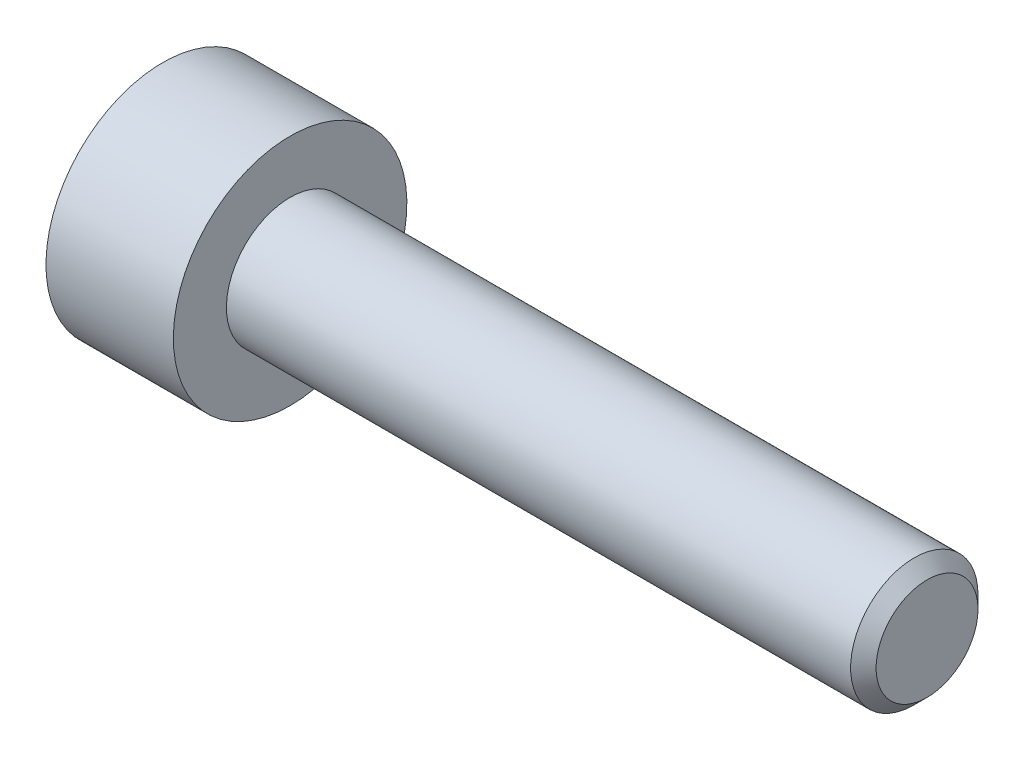
ISO-10303-21;
HEADER;
FILE_DESCRIPTION(('STEP AP214'),'2;1');
FILE_NAME('part.step','',(''),(''),'','','');
FILE_SCHEMA(('AUTOMOTIVE_DESIGN { 1 0 10303 214 1 1 1 1 }'));
ENDSEC;
DATA;
#1=APPLICATION_CONTEXT('core data for automotive mechanical design processes');
#2=APPLICATION_PROTOCOL_DEFINITION('international standard','automotive_design',2000,#1);
#3=PRODUCT_CONTEXT('',#1,'mechanical');
#4=PRODUCT('Part','Part','',(#3));
#5=PRODUCT_RELATED_PRODUCT_CATEGORY('part','',(#4));
#6=PRODUCT_DEFINITION_FORMATION('','',#4);
#7=PRODUCT_DEFINITION_CONTEXT('part definition',#1,'design');
#8=PRODUCT_DEFINITION('design','',#6,#7);
#9=PRODUCT_DEFINITION_SHAPE('','',#8);
#10=(LENGTH_UNIT() NAMED_UNIT(*) SI_UNIT(.MILLI.,.METRE.));
#11=(NAMED_UNIT(*) PLANE_ANGLE_UNIT() SI_UNIT($,.RADIAN.));
#12=(NAMED_UNIT(*) SI_UNIT($,.STERADIAN.) SOLID_ANGLE_UNIT());
#13=UNCERTAINTY_MEASURE_WITH_UNIT(LENGTH_MEASURE(1.E-05),#10,'distance_accuracy_value','');
#14=(GEOMETRIC_REPRESENTATION_CONTEXT(3) GLOBAL_UNCERTAINTY_ASSIGNED_CONTEXT((#13)) GLOBAL_UNIT_ASSIGNED_CONTEXT((#10,
#11,#12)) REPRESENTATION_CONTEXT('',''));
#15=CARTESIAN_POINT('',(0.,0.,0.));
#16=DIRECTION('',(0.,0.,1.));
#17=DIRECTION('',(1.,0.,0.));
#18=AXIS2_PLACEMENT_3D('',#15,#16,#17);
#19=CARTESIAN_POINT('',(-15.,0.,0.));
#20=DIRECTION('',(1.,0.,0.));
#21=DIRECTION('',(0.,0.,-1.));
#22=AXIS2_PLACEMENT_3D('',#19,#20,#21);
#23=CYLINDRICAL_SURFACE('',#22,1.5);
#24=CARTESIAN_POINT('',(-0.300000000000002,0.,0.));
#25=DIRECTION('',(1.,0.,0.));
#26=DIRECTION('',(0.,0.,-1.));
#27=AXIS2_PLACEMENT_3D('',#24,#25,#26);
#28=CIRCLE('',#27,1.5);
#29=CARTESIAN_POINT('',(-0.300000000000002,0.,-1.5));
#30=VERTEX_POINT('',#29);
#31=EDGE_CURVE('E45',#30,#30,#28,.F.);
#32=ORIENTED_EDGE('',*,*,#31,.T.);
#33=EDGE_LOOP('',(#32));
#34=FACE_BOUND('',#33,.T.);
#35=CARTESIAN_POINT('',(-15.,0.,0.));
#36=DIRECTION('',(-1.,0.,0.));
#37=DIRECTION('',(0.,-1.,0.));
#38=AXIS2_PLACEMENT_3D('',#35,#36,#37);
#39=CIRCLE('',#38,1.5);
#40=CARTESIAN_POINT('',(-15.,-1.50000000000001,0.));
#41=VERTEX_POINT('',#40);
#42=EDGE_CURVE('E121',#41,#41,#39,.F.);
#43=ORIENTED_EDGE('',*,*,#42,.T.);
#44=EDGE_LOOP('',(#43));
#45=FACE_BOUND('',#44,.T.);
#46=ADVANCED_FACE('F32',(#34,#45),#23,.T.);
#47=CARTESIAN_POINT('',(0.,0.,0.));
#48=DIRECTION('',(1.,0.,0.));
#49=DIRECTION('',(0.,0.,-1.));
#50=AXIS2_PLACEMENT_3D('',#47,#48,#49);
#51=PLANE('',#50);
#52=CARTESIAN_POINT('',(0.,0.,0.));
#53=DIRECTION('',(1.,0.,0.));
#54=DIRECTION('',(0.,0.,-1.));
#55=AXIS2_PLACEMENT_3D('',#52,#53,#54);
#56=CIRCLE('',#55,1.2);
#57=CARTESIAN_POINT('',(0.,0.,-1.2));
#58=VERTEX_POINT('',#57);
#59=EDGE_CURVE('E124',#58,#58,#56,.T.);
#60=ORIENTED_EDGE('',*,*,#59,.T.);
#61=EDGE_LOOP('',(#60));
#62=FACE_BOUND('',#61,.T.);
#63=ADVANCED_FACE('F134',(#62),#51,.T.);
#64=CARTESIAN_POINT('',(0.,0.,0.));
#65=DIRECTION('',(-1.,0.,0.));
#66=DIRECTION('',(0.,0.,1.));
#67=AXIS2_PLACEMENT_3D('',#64,#65,#66);
#68=CONICAL_SURFACE('',#67,1.2,0.785398163397449);
#69=ORIENTED_EDGE('',*,*,#31,.F.);
#70=EDGE_LOOP('',(#69));
#71=FACE_BOUND('',#70,.T.);
#72=ORIENTED_EDGE('',*,*,#59,.F.);
#73=EDGE_LOOP('',(#72));
#74=FACE_BOUND('',#73,.T.);
#75=ADVANCED_FACE('F34',(#71,#74),#68,.T.);
#76=CARTESIAN_POINT('',(-18.,0.,0.));
#77=DIRECTION('',(1.,0.,0.));
#78=DIRECTION('',(0.,1.,0.));
#79=AXIS2_PLACEMENT_3D('',#76,#77,#78);
#80=PLANE('',#79);
#81=CARTESIAN_POINT('',(-18.,0.,0.));
#82=DIRECTION('',(-1.,0.,0.));
#83=DIRECTION('',(0.,-1.,0.));
#84=AXIS2_PLACEMENT_3D('',#81,#82,#83);
#85=CIRCLE('',#84,1.49337567297411);
#86=CARTESIAN_POINT('',(-18.,-1.49337567297404,0.));
#87=VERTEX_POINT('',#86);
#88=EDGE_CURVE('E234',#87,#87,#85,.T.);
#89=ORIENTED_EDGE('',*,*,#88,.F.);
#90=EDGE_LOOP('',(#89));
#91=FACE_BOUND('',#90,.T.);
#92=CARTESIAN_POINT('',(-18.,0.,0.));
#93=DIRECTION('',(-1.,0.,0.));
#94=DIRECTION('',(0.,-1.,0.));
#95=AXIS2_PLACEMENT_3D('',#92,#93,#94);
#96=CIRCLE('',#95,2.74999999999998);
#97=CARTESIAN_POINT('',(-18.,-2.74999999999996,0.));
#98=VERTEX_POINT('',#97);
#99=EDGE_CURVE('E118',#98,#98,#96,.T.);
#100=ORIENTED_EDGE('',*,*,#99,.T.);
#101=EDGE_LOOP('',(#100));
#102=FACE_BOUND('',#101,.T.);
#103=ADVANCED_FACE('F133',(#91,#102),#80,.F.);
#104=CARTESIAN_POINT('',(-15.,0.,0.));
#105=DIRECTION('',(-1.,0.,0.));
#106=DIRECTION('',(0.,-1.,0.));
#107=AXIS2_PLACEMENT_3D('',#104,#105,#106);
#108=CYLINDRICAL_SURFACE('',#107,2.74999999999999);
#109=ORIENTED_EDGE('',*,*,#99,.F.);
#110=EDGE_LOOP('',(#109));
#111=FACE_BOUND('',#110,.T.);
#112=CARTESIAN_POINT('',(-15.,0.,0.));
#113=DIRECTION('',(-1.,0.,0.));
#114=DIRECTION('',(0.,-1.,0.));
#115=AXIS2_PLACEMENT_3D('',#112,#113,#114);
#116=CIRCLE('',#115,2.75);
#117=CARTESIAN_POINT('',(-15.,-2.75,0.));
#118=VERTEX_POINT('',#117);
#119=EDGE_CURVE('E115',#118,#118,#116,.T.);
#120=ORIENTED_EDGE('',*,*,#119,.T.);
#121=EDGE_LOOP('',(#120));
#122=FACE_BOUND('',#121,.T.);
#123=ADVANCED_FACE('F145',(#111,#122),#108,.T.);
#124=CARTESIAN_POINT('',(-15.,2.75,0.));
#125=DIRECTION('',(-1.,0.,0.));
#126=DIRECTION('',(0.,-1.,0.));
#127=AXIS2_PLACEMENT_3D('',#124,#125,#126);
#128=PLANE('',#127);
#129=ORIENTED_EDGE('',*,*,#42,.F.);
#130=EDGE_LOOP('',(#129));
#131=FACE_BOUND('',#130,.T.);
#132=ORIENTED_EDGE('',*,*,#119,.F.);
#133=EDGE_LOOP('',(#132));
#134=FACE_BOUND('',#133,.T.);
#135=ADVANCED_FACE('F149',(#131,#134),#128,.F.);
#136=CARTESIAN_POINT('',(-18.,0.,0.));
#137=DIRECTION('',(-1.,0.,0.));
#138=DIRECTION('',(0.,-1.,0.));
#139=AXIS2_PLACEMENT_3D('',#136,#137,#138);
#140=CONICAL_SURFACE('',#139,1.49337567297411,0.78539816339745);
#141=ORIENTED_EDGE('',*,*,#88,.T.);
#142=EDGE_LOOP('',(#141));
#143=FACE_BOUND('',#142,.T.);
#144=CARTESIAN_POINT('',(-18.4014021689884,-1.42396736984797,1.25));
#145=CARTESIAN_POINT('',(-18.375296136448,-1.38922450814774,1.25));
#146=CARTESIAN_POINT('',(-18.3494506563431,-1.35428640192995,1.25));
#147=CARTESIAN_POINT('',(-18.2983879120234,-1.28394100441962,1.25));
#148=CARTESIAN_POINT('',(-18.2731708093588,-1.24853359598575,1.25));
#149=CARTESIAN_POINT('',(-18.1982633539511,-1.14097140016118,1.25));
#150=CARTESIAN_POINT('',(-18.1497190435972,-1.06800495826749,1.25));
#151=CARTESIAN_POINT('',(-18.0545600162985,-0.915095472420334,1.25));
#152=CARTESIAN_POINT('',(-18.0082030382604,-0.834990154954476,1.25));
#153=CARTESIAN_POINT('',(-17.9235039270025,-0.670798348959389,1.25));
#154=CARTESIAN_POINT('',(-17.8851347978723,-0.586726487937136,1.25));
#155=CARTESIAN_POINT('',(-17.8381985020476,-0.460385334768672,1.25));
#156=CARTESIAN_POINT('',(-17.8247021207698,-0.419954113336578,1.25));
#157=CARTESIAN_POINT('',(-17.8009573074475,-0.338129031291256,1.25));
#158=CARTESIAN_POINT('',(-17.7907091035293,-0.296735103284148,1.25));
#159=CARTESIAN_POINT('',(-17.7741594663552,-0.213916243687761,1.25));
#160=CARTESIAN_POINT('',(-17.7677913385525,-0.172504848949309,1.25));
#161=CARTESIAN_POINT('',(-17.7591237196608,-0.0892560954741661,1.25));
#162=CARTESIAN_POINT('',(-17.7568235599981,-0.047418807870274,1.25));
#163=CARTESIAN_POINT('',(-17.7564564105193,0.0348235296905333,1.25));
#164=CARTESIAN_POINT('',(-17.7582455485415,0.0752279922917106,1.25));
#165=CARTESIAN_POINT('',(-17.7656448035135,0.15568700557964,1.25));
#166=CARTESIAN_POINT('',(-17.77125566297,0.195741486737995,1.25));
#167=CARTESIAN_POINT('',(-17.7860898151071,0.275882483894703,1.25));
#168=CARTESIAN_POINT('',(-17.7953738895404,0.315957579678807,1.25));
#169=CARTESIAN_POINT('',(-17.8170656964992,0.395234027395317,1.25));
#170=CARTESIAN_POINT('',(-17.8294731489784,0.434435457318958,1.25));
#171=CARTESIAN_POINT('',(-17.8734108304631,0.558570325397157,1.25));
#172=CARTESIAN_POINT('',(-17.9099744143289,0.641718054005976,1.25));
#173=CARTESIAN_POINT('',(-17.9912478873066,0.804100725662117,1.25));
#174=CARTESIAN_POINT('',(-18.0359871895297,0.883320183915907,1.25));
#175=CARTESIAN_POINT('',(-18.128265228646,1.03470895505826,1.25));
#176=CARTESIAN_POINT('',(-18.1755534388818,1.10703287925041,1.25));
#177=CARTESIAN_POINT('',(-18.2486463209252,1.21358798649194,1.25));
#178=CARTESIAN_POINT('',(-18.2732664432996,1.24864609054885,1.25));
#179=CARTESIAN_POINT('',(-18.323155260131,1.31828380805652,1.25));
#180=CARTESIAN_POINT('',(-18.3484237758017,1.35286354944697,1.25));
#181=CARTESIAN_POINT('',(-18.3739610581168,1.38724419886391,1.25));
#182=B_SPLINE_CURVE_WITH_KNOTS('',3,(#144,#145,#146,#147,#148,#149,#150,#151,#152,#153,#154,
#155,#156,#157,#158,#159,#160,#161,#162,#163,#164,#165,#166,#167,#168,#169,#170,#171,#172,#173,
#174,#175,#176,#177,#178,#179,#180,#181),.UNSPECIFIED.,.F.,.F.,(4,2,2,2,2,2,2,2,2,2,2,2,2,2,2,2,
2,2,4),(0.,0.130370422461752,0.260774023229283,0.523571931962192,0.800995227642812,
1.07746514553945,1.20522972687286,1.33300327939674,1.45851355132218,1.58400319361993,
1.70514602294325,1.826312395336,1.94957373840995,2.0728240336381,2.34451838945525,
2.61721016161588,2.87631588769065,3.00482945023604,3.13330794967365),.UNSPECIFIED.);
#183=CARTESIAN_POINT('',(-17.95,-0.721687836486964,1.25));
#184=VERTEX_POINT('',#183);
#185=CARTESIAN_POINT('',(-17.95,0.7216878364871,1.25));
#186=VERTEX_POINT('',#185);
#187=EDGE_CURVE('E99',#184,#186,#182,.T.);
#188=ORIENTED_EDGE('',*,*,#187,.F.);
#189=CARTESIAN_POINT('',(-17.9501154839091,-1.44349114302783,-0.000200000000000205));
#190=CARTESIAN_POINT('',(-17.9253216680551,-1.41867941875058,0.0427751670715871));
#191=CARTESIAN_POINT('',(-17.9019837344186,-1.39345276980736,0.0864690047459486));
#192=CARTESIAN_POINT('',(-17.8592520040845,-1.34201263554187,0.175565930841943));
#193=CARTESIAN_POINT('',(-17.8398819923604,-1.31579425481269,0.220977498357065));
#194=CARTESIAN_POINT('',(-17.8067004834134,-1.26292610442239,0.312547820935261));
#195=CARTESIAN_POINT('',(-17.7928055590526,-1.23628980770464,0.358683240175887));
#196=CARTESIAN_POINT('',(-17.7713972821606,-1.18243062538502,0.451970080407593));
#197=CARTESIAN_POINT('',(-17.7638679415668,-1.15520938653755,0.49911864913638));
#198=CARTESIAN_POINT('',(-17.7570744980507,-1.1082968436746,0.580373556887252));
#199=CARTESIAN_POINT('',(-17.7560685591043,-1.08866617256951,0.61437487662794));
#200=CARTESIAN_POINT('',(-17.7577614149113,-1.04943932800604,0.682317764432477));
#201=CARTESIAN_POINT('',(-17.7604610272155,-1.02984316311593,0.716259317655657));
#202=CARTESIAN_POINT('',(-17.7694089303163,-0.990839954603431,0.783814856457499));
#203=CARTESIAN_POINT('',(-17.7756605258997,-0.971433104248703,0.817428507286775));
#204=CARTESIAN_POINT('',(-17.7913756814139,-0.932943395609837,0.884094638217813));
#205=CARTESIAN_POINT('',(-17.8008406200874,-0.913860680098233,0.917146871030295));
#206=CARTESIAN_POINT('',(-17.8289313906876,-0.8649863513545,1.00179969160026));
#207=CARTESIAN_POINT('',(-17.8496701574522,-0.835502920149008,1.05286649242964));
#208=CARTESIAN_POINT('',(-17.8963871346714,-0.77769031947584,1.15300085411325));
#209=CARTESIAN_POINT('',(-17.9223482959467,-0.749357745598348,1.20207431157827));
#210=CARTESIAN_POINT('',(-17.9501154839091,-0.721572366433126,1.2502));
#211=B_SPLINE_CURVE_WITH_KNOTS('',3,(#189,#190,#191,#192,#193,#194,#195,#196,#197,#198,#199,
#200,#201,#202,#203,#204,#205,#206,#207,#208,#209,#210),.UNSPECIFIED.,.F.,.F.,(4,2,2,2,2,2,2,2,
2,2,4),(0.,0.166533409618304,0.334037607289763,0.498880396489699,0.663307919240274,
0.780963963458826,0.898645970148452,1.01643764860773,1.13427993171549,1.32148652032141,
1.50809158792574),.UNSPECIFIED.);
#212=CARTESIAN_POINT('',(-17.95,-1.443375672974,0.));
#213=VERTEX_POINT('',#212);
#214=EDGE_CURVE('E191',#213,#184,#211,.T.);
#215=ORIENTED_EDGE('',*,*,#214,.F.);
#216=CARTESIAN_POINT('',(-17.9501154839091,-0.721572366433125,-1.2502));
#217=CARTESIAN_POINT('',(-17.9253216680551,-0.746384090710375,-1.20722483292841));
#218=CARTESIAN_POINT('',(-17.9019837344186,-0.771610739653595,-1.16353099525405));
#219=CARTESIAN_POINT('',(-17.8592520040845,-0.823050873919086,-1.07443406915806));
#220=CARTESIAN_POINT('',(-17.8398819923604,-0.849269254648265,-1.02902250164294));
#221=CARTESIAN_POINT('',(-17.8067004834134,-0.902137405038567,-0.93745217906474));
#222=CARTESIAN_POINT('',(-17.7928055590526,-0.928773701756319,-0.891316759824114));
#223=CARTESIAN_POINT('',(-17.7713972821606,-0.982632884075945,-0.798029919592407));
#224=CARTESIAN_POINT('',(-17.7638679415668,-1.00985412292342,-0.750881350863619));
#225=CARTESIAN_POINT('',(-17.7570744980507,-1.05676666578636,-0.669626443112747));
#226=CARTESIAN_POINT('',(-17.7560685591043,-1.07639733689145,-0.635625123372058));
#227=CARTESIAN_POINT('',(-17.7577614149113,-1.11562418145492,-0.567682235567521));
#228=CARTESIAN_POINT('',(-17.7604610272155,-1.13522034634504,-0.533740682344341));
#229=CARTESIAN_POINT('',(-17.7694089303163,-1.17422355485753,-0.466185143542499));
#230=CARTESIAN_POINT('',(-17.7756605258997,-1.19363040521226,-0.432571492713224));
#231=CARTESIAN_POINT('',(-17.7913756814139,-1.23212011385112,-0.365905361782186));
#232=CARTESIAN_POINT('',(-17.8008406200874,-1.25120282936273,-0.332853128969703));
#233=CARTESIAN_POINT('',(-17.8289313906876,-1.30007715810646,-0.248200308399735));
#234=CARTESIAN_POINT('',(-17.8496701574522,-1.32956058931195,-0.197133507570362));
#235=CARTESIAN_POINT('',(-17.8963871346714,-1.38737318998512,-0.0969991458867468));
#236=CARTESIAN_POINT('',(-17.9223482959467,-1.41570576386261,-0.047925688421732));
#237=CARTESIAN_POINT('',(-17.9501154839091,-1.44349114302783,0.000199999999999059));
#238=B_SPLINE_CURVE_WITH_KNOTS('',3,(#216,#217,#218,#219,#220,#221,#222,#223,#224,#225,#226,
#227,#228,#229,#230,#231,#232,#233,#234,#235,#236,#237),.UNSPECIFIED.,.F.,.F.,(4,2,2,2,2,2,2,2,
2,2,4),(0.,0.166533409618304,0.334037607289764,0.498880396489701,0.663307919240277,
0.78096396345883,0.898645970148456,1.01643764860774,1.1342799317155,1.32148652032141,
1.50809158792574),.UNSPECIFIED.);
#239=CARTESIAN_POINT('',(-17.95,-0.721687836486964,-1.25));
#240=VERTEX_POINT('',#239);
#241=EDGE_CURVE('E186',#240,#213,#238,.T.);
#242=ORIENTED_EDGE('',*,*,#241,.F.);
#243=CARTESIAN_POINT('',(-18.4014021689884,-1.42396736984797,-1.25));
#244=CARTESIAN_POINT('',(-18.375296136448,-1.38922450814774,-1.25));
#245=CARTESIAN_POINT('',(-18.3494506563431,-1.35428640192995,-1.25));
#246=CARTESIAN_POINT('',(-18.2983879120234,-1.28394100441961,-1.25));
#247=CARTESIAN_POINT('',(-18.2731708093588,-1.24853359598575,-1.25));
#248=CARTESIAN_POINT('',(-18.1982633539511,-1.14097140016118,-1.25));
#249=CARTESIAN_POINT('',(-18.1497190435972,-1.06800495826749,-1.25));
#250=CARTESIAN_POINT('',(-18.0545600162985,-0.915095472420334,-1.25));
#251=CARTESIAN_POINT('',(-18.0082030382604,-0.834990154954475,-1.25));
#252=CARTESIAN_POINT('',(-17.9235039270025,-0.670798348959388,-1.25));
#253=CARTESIAN_POINT('',(-17.8851347978723,-0.586726487937136,-1.25));
#254=CARTESIAN_POINT('',(-17.8381985020476,-0.460385334768672,-1.25));
#255=CARTESIAN_POINT('',(-17.8247021207698,-0.419954113336578,-1.25));
#256=CARTESIAN_POINT('',(-17.8009573074475,-0.338129031291256,-1.25));
#257=CARTESIAN_POINT('',(-17.7907091035293,-0.296735103284148,-1.25));
#258=CARTESIAN_POINT('',(-17.7741594663552,-0.213916243687761,-1.25));
#259=CARTESIAN_POINT('',(-17.7677913385525,-0.172504848949309,-1.25));
#260=CARTESIAN_POINT('',(-17.7591237196608,-0.0892560954741656,-1.25));
#261=CARTESIAN_POINT('',(-17.7568235599981,-0.0474188078702733,-1.25));
#262=CARTESIAN_POINT('',(-17.7564564105193,0.0348235296905343,-1.25));
#263=CARTESIAN_POINT('',(-17.7582455485415,0.0752279922917117,-1.25));
#264=CARTESIAN_POINT('',(-17.7656448035135,0.155687005579641,-1.25));
#265=CARTESIAN_POINT('',(-17.77125566297,0.195741486737995,-1.25));
#266=CARTESIAN_POINT('',(-17.7860898151071,0.275882483894704,-1.25));
#267=CARTESIAN_POINT('',(-17.7953738895404,0.315957579678808,-1.25));
#268=CARTESIAN_POINT('',(-17.8170656964992,0.395234027395317,-1.25));
#269=CARTESIAN_POINT('',(-17.8294731489784,0.434435457318958,-1.25));
#270=CARTESIAN_POINT('',(-17.8734108304631,0.558570325397157,-1.25));
#271=CARTESIAN_POINT('',(-17.9099744143289,0.641718054005978,-1.25));
#272=CARTESIAN_POINT('',(-17.9912478873066,0.80410072566212,-1.25));
#273=CARTESIAN_POINT('',(-18.0359871895297,0.883320183915909,-1.25));
#274=CARTESIAN_POINT('',(-18.128265228646,1.03470895505826,-1.25));
#275=CARTESIAN_POINT('',(-18.1755534388818,1.10703287925041,-1.25));
#276=CARTESIAN_POINT('',(-18.2486463209252,1.21358798649194,-1.25));
#277=CARTESIAN_POINT('',(-18.2732664432995,1.24864609054885,-1.25));
#278=CARTESIAN_POINT('',(-18.323155260131,1.31828380805652,-1.25));
#279=CARTESIAN_POINT('',(-18.3484237758017,1.35286354944697,-1.25));
#280=CARTESIAN_POINT('',(-18.3739610581168,1.38724419886391,-1.25));
#281=B_SPLINE_CURVE_WITH_KNOTS('',3,(#243,#244,#245,#246,#247,#248,#249,#250,#251,#252,#253,
#254,#255,#256,#257,#258,#259,#260,#261,#262,#263,#264,#265,#266,#267,#268,#269,#270,#271,#272,
#273,#274,#275,#276,#277,#278,#279,#280),.UNSPECIFIED.,.F.,.F.,(4,2,2,2,2,2,2,2,2,2,2,2,2,2,2,2,
2,2,4),(0.,0.130370422461752,0.260774023229283,0.523571931962191,0.800995227642812,
1.07746514553944,1.20522972687285,1.33300327939674,1.45851355132218,1.58400319361993,
1.70514602294325,1.826312395336,1.94957373840995,2.0728240336381,2.34451838945525,
2.61721016161588,2.87631588769065,3.00482945023603,3.13330794967365),.UNSPECIFIED.);
#282=CARTESIAN_POINT('',(-17.95,0.721687836487101,-1.25));
#283=VERTEX_POINT('',#282);
#284=EDGE_CURVE('E52',#283,#240,#281,.F.);
#285=ORIENTED_EDGE('',*,*,#284,.F.);
#286=CARTESIAN_POINT('',(-17.9501154839091,1.44349114302797,0.000200000000000217));
#287=CARTESIAN_POINT('',(-17.9253216680551,1.41867941875072,-0.0427751670715851));
#288=CARTESIAN_POINT('',(-17.9019837344186,1.3934527698075,-0.0864690047459459));
#289=CARTESIAN_POINT('',(-17.8592520040845,1.34201263554201,-0.175565930841939));
#290=CARTESIAN_POINT('',(-17.8398819923604,1.31579425481283,-0.220977498357062));
#291=CARTESIAN_POINT('',(-17.8067004834134,1.26292610442253,-0.312547820935258));
#292=CARTESIAN_POINT('',(-17.7928055590526,1.23628980770478,-0.358683240175883));
#293=CARTESIAN_POINT('',(-17.7713972821606,1.18243062538515,-0.45197008040759));
#294=CARTESIAN_POINT('',(-17.7638679415667,1.15520938653768,-0.499118649136377));
#295=CARTESIAN_POINT('',(-17.7570744980507,1.10829684367474,-0.58037355688725));
#296=CARTESIAN_POINT('',(-17.7560685591043,1.08866617256965,-0.614374876627938));
#297=CARTESIAN_POINT('',(-17.7577614149113,1.04943932800618,-0.682317764432475));
#298=CARTESIAN_POINT('',(-17.7604610272155,1.02984316311606,-0.716259317655655));
#299=CARTESIAN_POINT('',(-17.7694089303163,0.990839954603569,-0.783814856457496));
#300=CARTESIAN_POINT('',(-17.7756605258997,0.971433104248841,-0.817428507286772));
#301=CARTESIAN_POINT('',(-17.7913756814139,0.932943395609975,-0.88409463821781));
#302=CARTESIAN_POINT('',(-17.8008406200874,0.91386068009837,-0.917146871030292));
#303=CARTESIAN_POINT('',(-17.8289313906875,0.864986351354637,-1.00179969160026));
#304=CARTESIAN_POINT('',(-17.8496701574522,0.835502920149145,-1.05286649242964));
#305=CARTESIAN_POINT('',(-17.8963871346714,0.777690319475978,-1.15300085411325));
#306=CARTESIAN_POINT('',(-17.9223482959467,0.749357745598486,-1.20207431157827));
#307=CARTESIAN_POINT('',(-17.9501154839091,0.721572366433263,-1.2502));
#308=B_SPLINE_CURVE_WITH_KNOTS('',3,(#286,#287,#288,#289,#290,#291,#292,#293,#294,#295,#296,
#297,#298,#299,#300,#301,#302,#303,#304,#305,#306,#307),.UNSPECIFIED.,.F.,.F.,(4,2,2,2,2,2,2,2,
2,2,4),(0.,0.166533409618301,0.334037607289759,0.498880396489695,0.663307919240271,
0.780963963458824,0.898645970148449,1.01643764860773,1.13427993171549,1.3214865203214,
1.50809158792573),.UNSPECIFIED.);
#309=CARTESIAN_POINT('',(-17.95,1.44337567297413,0.));
#310=VERTEX_POINT('',#309);
#311=EDGE_CURVE('E11',#310,#283,#308,.T.);
#312=ORIENTED_EDGE('',*,*,#311,.F.);
#313=CARTESIAN_POINT('',(-17.9501154839091,0.721572366433263,1.2502));
#314=CARTESIAN_POINT('',(-17.9253216680551,0.746384090710512,1.20722483292841));
#315=CARTESIAN_POINT('',(-17.9019837344186,0.771610739653732,1.16353099525405));
#316=CARTESIAN_POINT('',(-17.8592520040845,0.823050873919222,1.07443406915806));
#317=CARTESIAN_POINT('',(-17.8398819923604,0.8492692546484,1.02902250164294));
#318=CARTESIAN_POINT('',(-17.8067004834134,0.902137405038702,0.937452179064742));
#319=CARTESIAN_POINT('',(-17.7928055590526,0.928773701756454,0.891316759824116));
#320=CARTESIAN_POINT('',(-17.7713972821606,0.982632884076079,0.798029919592409));
#321=CARTESIAN_POINT('',(-17.7638679415667,1.00985412292355,0.750881350863622));
#322=CARTESIAN_POINT('',(-17.7570744980507,1.05676666578649,0.669626443112749));
#323=CARTESIAN_POINT('',(-17.7560685591043,1.07639733689158,0.635625123372061));
#324=CARTESIAN_POINT('',(-17.7577614149113,1.11562418145505,0.567682235567525));
#325=CARTESIAN_POINT('',(-17.7604610272155,1.13522034634517,0.533740682344344));
#326=CARTESIAN_POINT('',(-17.7694089303163,1.17422355485766,0.466185143542503));
#327=CARTESIAN_POINT('',(-17.7756605258997,1.19363040521239,0.432571492713228));
#328=CARTESIAN_POINT('',(-17.7913756814139,1.23212011385126,0.36590536178219));
#329=CARTESIAN_POINT('',(-17.8008406200874,1.25120282936286,0.332853128969707));
#330=CARTESIAN_POINT('',(-17.8289313906875,1.3000771581066,0.248200308399738));
#331=CARTESIAN_POINT('',(-17.8496701574522,1.32956058931209,0.197133507570363));
#332=CARTESIAN_POINT('',(-17.8963871346714,1.38737318998526,0.0969991458867462));
#333=CARTESIAN_POINT('',(-17.9223482959467,1.41570576386275,0.0479256884217315));
#334=CARTESIAN_POINT('',(-17.9501154839091,1.44349114302797,-0.000199999999999052));
#335=B_SPLINE_CURVE_WITH_KNOTS('',3,(#313,#314,#315,#316,#317,#318,#319,#320,#321,#322,#323,
#324,#325,#326,#327,#328,#329,#330,#331,#332,#333,#334),.UNSPECIFIED.,.F.,.F.,(4,2,2,2,2,2,2,2,
2,2,4),(0.,0.166533409618302,0.33403760728976,0.498880396489696,0.663307919240272,
0.780963963458824,0.89864597014845,1.01643764860773,1.13427993171549,1.32148652032141,
1.50809158792573),.UNSPECIFIED.);
#336=EDGE_CURVE('E90',#186,#310,#335,.T.);
#337=ORIENTED_EDGE('',*,*,#336,.F.);
#338=EDGE_LOOP('',(#188,#215,#242,#285,#312,#337));
#339=FACE_BOUND('',#338,.T.);
#340=ADVANCED_FACE('F89',(#143,#339),#140,.F.);
#341=CARTESIAN_POINT('',(-16.4,0.,0.));
#342=DIRECTION('',(-1.,0.,0.));
#343=DIRECTION('',(0.,-1.,0.));
#344=AXIS2_PLACEMENT_3D('',#341,#342,#343);
#345=PLANE('',#344);
#346=DIRECTION('',(0.,0.5,-0.866025403784438));
#347=VECTOR('',#346,1.);
#348=CARTESIAN_POINT('',(-16.4,0.721687836487095,1.25));
#349=LINE('',#348,#347);
#350=CARTESIAN_POINT('',(-16.4,0.721687836487095,1.25));
#351=VERTEX_POINT('',#350);
#352=CARTESIAN_POINT('',(-16.4,1.44337567297413,0.));
#353=VERTEX_POINT('',#352);
#354=EDGE_CURVE('E98',#351,#353,#349,.T.);
#355=ORIENTED_EDGE('',*,*,#354,.T.);
#356=DIRECTION('',(0.,-0.5,-0.866025403784439));
#357=VECTOR('',#356,1.);
#358=CARTESIAN_POINT('',(-16.4,1.44337567297413,0.));
#359=LINE('',#358,#357);
#360=CARTESIAN_POINT('',(-16.4,0.721687836487095,-1.25));
#361=VERTEX_POINT('',#360);
#362=EDGE_CURVE('E103',#353,#361,#359,.T.);
#363=ORIENTED_EDGE('',*,*,#362,.T.);
#364=DIRECTION('',(0.,-1.,0.));
#365=VECTOR('',#364,1.);
#366=CARTESIAN_POINT('',(-16.4,0.721687836487095,-1.25));
#367=LINE('',#366,#365);
#368=CARTESIAN_POINT('',(-16.4,-0.721687836486969,-1.25));
#369=VERTEX_POINT('',#368);
#370=EDGE_CURVE('E216',#361,#369,#367,.T.);
#371=ORIENTED_EDGE('',*,*,#370,.T.);
#372=DIRECTION('',(0.,-0.5,0.866025403784439));
#373=VECTOR('',#372,1.);
#374=CARTESIAN_POINT('',(-16.4,-0.721687836486969,-1.25));
#375=LINE('',#374,#373);
#376=CARTESIAN_POINT('',(-16.4,-1.443375672974,0.));
#377=VERTEX_POINT('',#376);
#378=EDGE_CURVE('E220',#369,#377,#375,.T.);
#379=ORIENTED_EDGE('',*,*,#378,.T.);
#380=DIRECTION('',(0.,0.5,0.866025403784439));
#381=VECTOR('',#380,1.);
#382=CARTESIAN_POINT('',(-16.4,-1.443375672974,0.));
#383=LINE('',#382,#381);
#384=CARTESIAN_POINT('',(-16.4,-0.72168783648697,1.25));
#385=VERTEX_POINT('',#384);
#386=EDGE_CURVE('E111',#377,#385,#383,.T.);
#387=ORIENTED_EDGE('',*,*,#386,.T.);
#388=DIRECTION('',(0.,1.,0.));
#389=VECTOR('',#388,1.);
#390=CARTESIAN_POINT('',(-16.4,-0.72168783648697,1.25));
#391=LINE('',#390,#389);
#392=EDGE_CURVE('E106',#385,#351,#391,.T.);
#393=ORIENTED_EDGE('',*,*,#392,.T.);
#394=EDGE_LOOP('',(#355,#363,#371,#379,#387,#393));
#395=FACE_BOUND('',#394,.T.);
#396=ADVANCED_FACE('F173',(#395),#345,.T.);
#397=CARTESIAN_POINT('',(-16.4,1.44337567297413,0.));
#398=DIRECTION('',(0.,0.866025403784439,-0.5));
#399=DIRECTION('',(0.,0.5,0.866025403784439));
#400=AXIS2_PLACEMENT_3D('',#397,#398,#399);
#401=PLANE('',#400);
#402=DIRECTION('',(-1.,0.,0.));
#403=VECTOR('',#402,1.);
#404=CARTESIAN_POINT('',(-16.4,1.44337567297413,0.));
#405=LINE('',#404,#403);
#406=EDGE_CURVE('E96',#353,#310,#405,.T.);
#407=ORIENTED_EDGE('',*,*,#406,.T.);
#408=ORIENTED_EDGE('',*,*,#311,.T.);
#409=DIRECTION('',(-1.,0.,0.));
#410=VECTOR('',#409,1.);
#411=CARTESIAN_POINT('',(-16.4,0.721687836487095,-1.25));
#412=LINE('',#411,#410);
#413=EDGE_CURVE('E105',#361,#283,#412,.T.);
#414=ORIENTED_EDGE('',*,*,#413,.F.);
#415=ORIENTED_EDGE('',*,*,#362,.F.);
#416=EDGE_LOOP('',(#407,#408,#414,#415));
#417=FACE_BOUND('',#416,.T.);
#418=ADVANCED_FACE('F101',(#417),#401,.F.);
#419=CARTESIAN_POINT('',(-16.4,0.721687836487095,-1.25));
#420=DIRECTION('',(0.,0.,-1.));
#421=DIRECTION('',(-1.,0.,0.));
#422=AXIS2_PLACEMENT_3D('',#419,#420,#421);
#423=PLANE('',#422);
#424=ORIENTED_EDGE('',*,*,#413,.T.);
#425=ORIENTED_EDGE('',*,*,#284,.T.);
#426=DIRECTION('',(-1.,0.,0.));
#427=VECTOR('',#426,1.);
#428=CARTESIAN_POINT('',(-16.4,-0.721687836486969,-1.25));
#429=LINE('',#428,#427);
#430=EDGE_CURVE('E108',#369,#240,#429,.T.);
#431=ORIENTED_EDGE('',*,*,#430,.F.);
#432=ORIENTED_EDGE('',*,*,#370,.F.);
#433=EDGE_LOOP('',(#424,#425,#431,#432));
#434=FACE_BOUND('',#433,.T.);
#435=ADVANCED_FACE('F205',(#434),#423,.F.);
#436=CARTESIAN_POINT('',(-16.4,-0.721687836486969,-1.25));
#437=DIRECTION('',(0.,-0.866025403784438,-0.5));
#438=DIRECTION('',(0.,0.5,-0.866025403784439));
#439=AXIS2_PLACEMENT_3D('',#436,#437,#438);
#440=PLANE('',#439);
#441=ORIENTED_EDGE('',*,*,#430,.T.);
#442=ORIENTED_EDGE('',*,*,#241,.T.);
#443=DIRECTION('',(-1.,0.,0.));
#444=VECTOR('',#443,1.);
#445=CARTESIAN_POINT('',(-16.4,-1.443375672974,0.));
#446=LINE('',#445,#444);
#447=EDGE_CURVE('E230',#377,#213,#446,.T.);
#448=ORIENTED_EDGE('',*,*,#447,.F.);
#449=ORIENTED_EDGE('',*,*,#378,.F.);
#450=EDGE_LOOP('',(#441,#442,#448,#449));
#451=FACE_BOUND('',#450,.T.);
#452=ADVANCED_FACE('F200',(#451),#440,.F.);
#453=CARTESIAN_POINT('',(-16.4,-1.443375672974,0.));
#454=DIRECTION('',(0.,-0.866025403784439,0.5));
#455=DIRECTION('',(0.,-0.5,-0.866025403784439));
#456=AXIS2_PLACEMENT_3D('',#453,#454,#455);
#457=PLANE('',#456);
#458=ORIENTED_EDGE('',*,*,#447,.T.);
#459=ORIENTED_EDGE('',*,*,#214,.T.);
#460=DIRECTION('',(-1.,0.,0.));
#461=VECTOR('',#460,1.);
#462=CARTESIAN_POINT('',(-16.4,-0.72168783648697,1.25));
#463=LINE('',#462,#461);
#464=EDGE_CURVE('E227',#385,#184,#463,.T.);
#465=ORIENTED_EDGE('',*,*,#464,.F.);
#466=ORIENTED_EDGE('',*,*,#386,.F.);
#467=EDGE_LOOP('',(#458,#459,#465,#466));
#468=FACE_BOUND('',#467,.T.);
#469=ADVANCED_FACE('F197',(#468),#457,.F.);
#470=CARTESIAN_POINT('',(-16.4,-0.72168783648697,1.25));
#471=DIRECTION('',(0.,0.,1.));
#472=DIRECTION('',(1.,0.,0.));
#473=AXIS2_PLACEMENT_3D('',#470,#471,#472);
#474=PLANE('',#473);
#475=ORIENTED_EDGE('',*,*,#464,.T.);
#476=ORIENTED_EDGE('',*,*,#187,.T.);
#477=DIRECTION('',(-1.,0.,0.));
#478=VECTOR('',#477,1.);
#479=CARTESIAN_POINT('',(-16.4,0.721687836487095,1.25));
#480=LINE('',#479,#478);
#481=EDGE_CURVE('E59',#351,#186,#480,.T.);
#482=ORIENTED_EDGE('',*,*,#481,.F.);
#483=ORIENTED_EDGE('',*,*,#392,.F.);
#484=EDGE_LOOP('',(#475,#476,#482,#483));
#485=FACE_BOUND('',#484,.T.);
#486=ADVANCED_FACE('F156',(#485),#474,.F.);
#487=CARTESIAN_POINT('',(-16.4,0.721687836487095,1.25));
#488=DIRECTION('',(0.,0.866025403784438,0.5));
#489=DIRECTION('',(0.,-0.5,0.866025403784439));
#490=AXIS2_PLACEMENT_3D('',#487,#488,#489);
#491=PLANE('',#490);
#492=ORIENTED_EDGE('',*,*,#481,.T.);
#493=ORIENTED_EDGE('',*,*,#336,.T.);
#494=ORIENTED_EDGE('',*,*,#406,.F.);
#495=ORIENTED_EDGE('',*,*,#354,.F.);
#496=EDGE_LOOP('',(#492,#493,#494,#495));
#497=FACE_BOUND('',#496,.T.);
#498=ADVANCED_FACE('F95',(#497),#491,.F.);
#499=CLOSED_SHELL('',(#46,#63,#75,#103,#123,#135,#340,#396,#418,#435,#452,#469,#486,#498));
#500=MANIFOLD_SOLID_BREP('B2',#499);
#501=ADVANCED_BREP_SHAPE_REPRESENTATION('',(#18,#500),#14);
#502=SHAPE_DEFINITION_REPRESENTATION(#9,#501);
ENDSEC;
END-ISO-10303-21;
